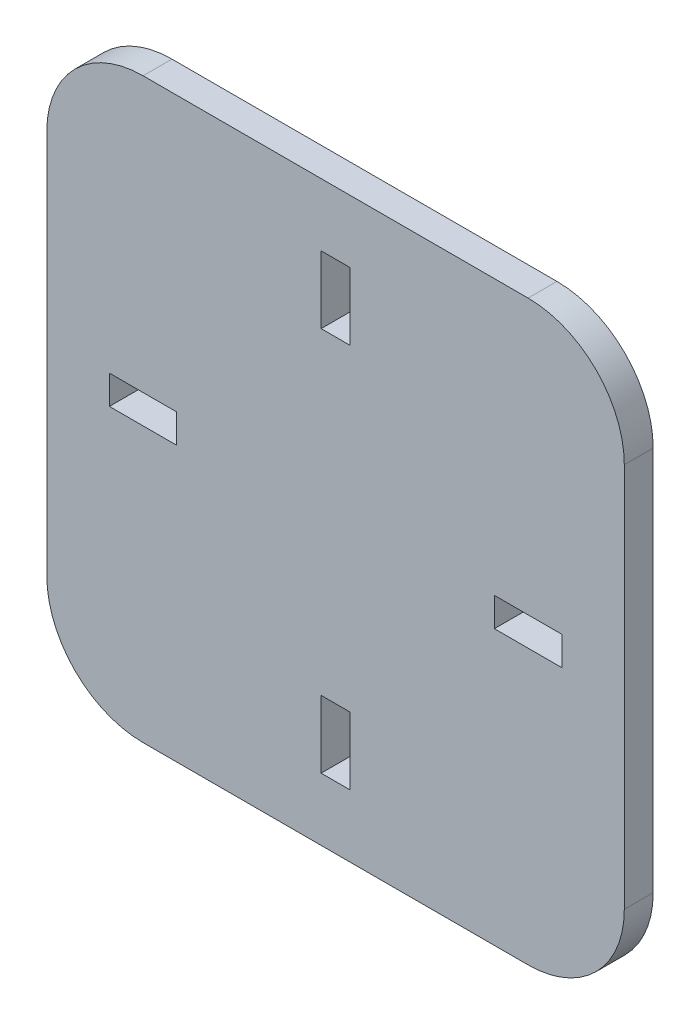
ISO-10303-21;
HEADER;
FILE_DESCRIPTION(('STEP AP214'),'2;1');
FILE_NAME('part.step','',(''),(''),'','','');
FILE_SCHEMA(('AUTOMOTIVE_DESIGN { 1 0 10303 214 1 1 1 1 }'));
ENDSEC;
DATA;
#1=APPLICATION_CONTEXT('core data for automotive mechanical design processes');
#2=APPLICATION_PROTOCOL_DEFINITION('international standard','automotive_design',2000,#1);
#3=PRODUCT_CONTEXT('',#1,'mechanical');
#4=PRODUCT('Part','Part','',(#3));
#5=PRODUCT_RELATED_PRODUCT_CATEGORY('part','',(#4));
#6=PRODUCT_DEFINITION_FORMATION('','',#4);
#7=PRODUCT_DEFINITION_CONTEXT('part definition',#1,'design');
#8=PRODUCT_DEFINITION('design','',#6,#7);
#9=PRODUCT_DEFINITION_SHAPE('','',#8);
#10=(LENGTH_UNIT() NAMED_UNIT(*) SI_UNIT(.MILLI.,.METRE.));
#11=(NAMED_UNIT(*) PLANE_ANGLE_UNIT() SI_UNIT($,.RADIAN.));
#12=(NAMED_UNIT(*) SI_UNIT($,.STERADIAN.) SOLID_ANGLE_UNIT());
#13=UNCERTAINTY_MEASURE_WITH_UNIT(LENGTH_MEASURE(1.E-05),#10,'distance_accuracy_value','');
#14=(GEOMETRIC_REPRESENTATION_CONTEXT(3) GLOBAL_UNCERTAINTY_ASSIGNED_CONTEXT((#13)) GLOBAL_UNIT_ASSIGNED_CONTEXT((#10,
#11,#12)) REPRESENTATION_CONTEXT('',''));
#15=CARTESIAN_POINT('',(0.,0.,0.));
#16=DIRECTION('',(0.,0.,1.));
#17=DIRECTION('',(1.,0.,0.));
#18=AXIS2_PLACEMENT_3D('',#15,#16,#17);
#19=CARTESIAN_POINT('',(30.,-30.,3.));
#20=DIRECTION('',(-1.,0.,0.));
#21=DIRECTION('',(0.,0.,1.));
#22=AXIS2_PLACEMENT_3D('',#19,#20,#21);
#23=PLANE('',#22);
#24=DIRECTION('',(0.,1.,0.));
#25=VECTOR('',#24,1.);
#26=CARTESIAN_POINT('',(30.,-30.,0.));
#27=LINE('',#26,#25);
#28=CARTESIAN_POINT('',(30.,-20.,0.));
#29=VERTEX_POINT('',#28);
#30=CARTESIAN_POINT('',(30.,20.,0.));
#31=VERTEX_POINT('',#30);
#32=EDGE_CURVE('E241',#29,#31,#27,.T.);
#33=ORIENTED_EDGE('',*,*,#32,.T.);
#34=DIRECTION('',(0.,0.,-1.));
#35=VECTOR('',#34,1.);
#36=CARTESIAN_POINT('',(30.,20.,3.));
#37=LINE('',#36,#35);
#38=CARTESIAN_POINT('',(30.,20.,3.));
#39=VERTEX_POINT('',#38);
#40=EDGE_CURVE('E388',#31,#39,#37,.F.);
#41=ORIENTED_EDGE('',*,*,#40,.T.);
#42=DIRECTION('',(0.,1.,0.));
#43=VECTOR('',#42,1.);
#44=CARTESIAN_POINT('',(30.,-30.,3.));
#45=LINE('',#44,#43);
#46=CARTESIAN_POINT('',(30.,-20.,3.));
#47=VERTEX_POINT('',#46);
#48=EDGE_CURVE('E340',#47,#39,#45,.T.);
#49=ORIENTED_EDGE('',*,*,#48,.F.);
#50=DIRECTION('',(0.,0.,-1.));
#51=VECTOR('',#50,1.);
#52=CARTESIAN_POINT('',(30.,-20.,3.));
#53=LINE('',#52,#51);
#54=EDGE_CURVE('E385',#47,#29,#53,.T.);
#55=ORIENTED_EDGE('',*,*,#54,.T.);
#56=EDGE_LOOP('',(#33,#41,#49,#55));
#57=FACE_BOUND('',#56,.T.);
#58=ADVANCED_FACE('F39',(#57),#23,.F.);
#59=CARTESIAN_POINT('',(-30.,30.,3.));
#60=DIRECTION('',(0.,-1.,0.));
#61=DIRECTION('',(0.,0.,-1.));
#62=AXIS2_PLACEMENT_3D('',#59,#60,#61);
#63=PLANE('',#62);
#64=DIRECTION('',(-1.,0.,0.));
#65=VECTOR('',#64,1.);
#66=CARTESIAN_POINT('',(-30.,30.,0.));
#67=LINE('',#66,#65);
#68=CARTESIAN_POINT('',(20.,30.,0.));
#69=VERTEX_POINT('',#68);
#70=CARTESIAN_POINT('',(-20.,30.,0.));
#71=VERTEX_POINT('',#70);
#72=EDGE_CURVE('E354',#69,#71,#67,.T.);
#73=ORIENTED_EDGE('',*,*,#72,.T.);
#74=DIRECTION('',(0.,0.,-1.));
#75=VECTOR('',#74,1.);
#76=CARTESIAN_POINT('',(-20.,30.,3.));
#77=LINE('',#76,#75);
#78=CARTESIAN_POINT('',(-20.,30.,3.));
#79=VERTEX_POINT('',#78);
#80=EDGE_CURVE('E376',#71,#79,#77,.F.);
#81=ORIENTED_EDGE('',*,*,#80,.T.);
#82=DIRECTION('',(-1.,0.,0.));
#83=VECTOR('',#82,1.);
#84=CARTESIAN_POINT('',(-30.,30.,3.));
#85=LINE('',#84,#83);
#86=CARTESIAN_POINT('',(20.,30.,3.));
#87=VERTEX_POINT('',#86);
#88=EDGE_CURVE('E343',#87,#79,#85,.T.);
#89=ORIENTED_EDGE('',*,*,#88,.F.);
#90=DIRECTION('',(0.,0.,-1.));
#91=VECTOR('',#90,1.);
#92=CARTESIAN_POINT('',(20.,30.,3.));
#93=LINE('',#92,#91);
#94=EDGE_CURVE('E373',#87,#69,#93,.T.);
#95=ORIENTED_EDGE('',*,*,#94,.T.);
#96=EDGE_LOOP('',(#73,#81,#89,#95));
#97=FACE_BOUND('',#96,.T.);
#98=ADVANCED_FACE('F412',(#97),#63,.F.);
#99=CARTESIAN_POINT('',(-30.,-30.,3.));
#100=DIRECTION('',(1.,0.,0.));
#101=DIRECTION('',(0.,0.,-1.));
#102=AXIS2_PLACEMENT_3D('',#99,#100,#101);
#103=PLANE('',#102);
#104=DIRECTION('',(0.,-1.,0.));
#105=VECTOR('',#104,1.);
#106=CARTESIAN_POINT('',(-30.,-30.,3.));
#107=LINE('',#106,#105);
#108=CARTESIAN_POINT('',(-30.,20.,3.));
#109=VERTEX_POINT('',#108);
#110=CARTESIAN_POINT('',(-30.,-20.,3.));
#111=VERTEX_POINT('',#110);
#112=EDGE_CURVE('E347',#109,#111,#107,.T.);
#113=ORIENTED_EDGE('',*,*,#112,.F.);
#114=DIRECTION('',(0.,0.,-1.));
#115=VECTOR('',#114,1.);
#116=CARTESIAN_POINT('',(-30.,20.,3.));
#117=LINE('',#116,#115);
#118=CARTESIAN_POINT('',(-30.,20.,0.));
#119=VERTEX_POINT('',#118);
#120=EDGE_CURVE('E362',#109,#119,#117,.T.);
#121=ORIENTED_EDGE('',*,*,#120,.T.);
#122=DIRECTION('',(0.,-1.,0.));
#123=VECTOR('',#122,1.);
#124=CARTESIAN_POINT('',(-30.,-30.,0.));
#125=LINE('',#124,#123);
#126=CARTESIAN_POINT('',(-30.,-20.,0.));
#127=VERTEX_POINT('',#126);
#128=EDGE_CURVE('E357',#119,#127,#125,.T.);
#129=ORIENTED_EDGE('',*,*,#128,.T.);
#130=DIRECTION('',(0.,0.,-1.));
#131=VECTOR('',#130,1.);
#132=CARTESIAN_POINT('',(-30.,-20.,3.));
#133=LINE('',#132,#131);
#134=EDGE_CURVE('E351',#127,#111,#133,.F.);
#135=ORIENTED_EDGE('',*,*,#134,.T.);
#136=EDGE_LOOP('',(#113,#121,#129,#135));
#137=FACE_BOUND('',#136,.T.);
#138=ADVANCED_FACE('F420',(#137),#103,.F.);
#139=CARTESIAN_POINT('',(-30.,-30.,3.));
#140=DIRECTION('',(0.,1.,0.));
#141=DIRECTION('',(0.,0.,1.));
#142=AXIS2_PLACEMENT_3D('',#139,#140,#141);
#143=PLANE('',#142);
#144=DIRECTION('',(1.,0.,0.));
#145=VECTOR('',#144,1.);
#146=CARTESIAN_POINT('',(-30.,-30.,0.));
#147=LINE('',#146,#145);
#148=CARTESIAN_POINT('',(-20.,-30.,0.));
#149=VERTEX_POINT('',#148);
#150=CARTESIAN_POINT('',(20.,-30.,0.));
#151=VERTEX_POINT('',#150);
#152=EDGE_CURVE('E344',#149,#151,#147,.T.);
#153=ORIENTED_EDGE('',*,*,#152,.T.);
#154=DIRECTION('',(0.,0.,-1.));
#155=VECTOR('',#154,1.);
#156=CARTESIAN_POINT('',(20.,-30.,3.));
#157=LINE('',#156,#155);
#158=CARTESIAN_POINT('',(20.,-30.,3.));
#159=VERTEX_POINT('',#158);
#160=EDGE_CURVE('E11',#151,#159,#157,.F.);
#161=ORIENTED_EDGE('',*,*,#160,.T.);
#162=DIRECTION('',(1.,0.,0.));
#163=VECTOR('',#162,1.);
#164=CARTESIAN_POINT('',(-30.,-30.,3.));
#165=LINE('',#164,#163);
#166=CARTESIAN_POINT('',(-20.,-30.,3.));
#167=VERTEX_POINT('',#166);
#168=EDGE_CURVE('E349',#167,#159,#165,.T.);
#169=ORIENTED_EDGE('',*,*,#168,.F.);
#170=DIRECTION('',(0.,0.,-1.));
#171=VECTOR('',#170,1.);
#172=CARTESIAN_POINT('',(-20.,-30.,3.));
#173=LINE('',#172,#171);
#174=EDGE_CURVE('E47',#167,#149,#173,.T.);
#175=ORIENTED_EDGE('',*,*,#174,.T.);
#176=EDGE_LOOP('',(#153,#161,#169,#175));
#177=FACE_BOUND('',#176,.T.);
#178=ADVANCED_FACE('F392',(#177),#143,.F.);
#179=CARTESIAN_POINT('',(0.,0.,3.));
#180=DIRECTION('',(0.,0.,-1.));
#181=DIRECTION('',(-1.,0.,0.));
#182=AXIS2_PLACEMENT_3D('',#179,#180,#181);
#183=PLANE('',#182);
#184=DIRECTION('',(-1.,0.,0.));
#185=VECTOR('',#184,1.);
#186=CARTESIAN_POINT('',(16.5,1.5,3.));
#187=LINE('',#186,#185);
#188=CARTESIAN_POINT('',(23.5,1.5,3.));
#189=VERTEX_POINT('',#188);
#190=CARTESIAN_POINT('',(16.5,1.5,3.));
#191=VERTEX_POINT('',#190);
#192=EDGE_CURVE('E234',#189,#191,#187,.T.);
#193=ORIENTED_EDGE('',*,*,#192,.F.);
#194=DIRECTION('',(0.,1.,0.));
#195=VECTOR('',#194,1.);
#196=CARTESIAN_POINT('',(23.5,1.5,3.));
#197=LINE('',#196,#195);
#198=CARTESIAN_POINT('',(23.5,-1.5,3.));
#199=VERTEX_POINT('',#198);
#200=EDGE_CURVE('E207',#199,#189,#197,.T.);
#201=ORIENTED_EDGE('',*,*,#200,.F.);
#202=DIRECTION('',(1.,0.,0.));
#203=VECTOR('',#202,1.);
#204=CARTESIAN_POINT('',(16.5,-1.5,3.));
#205=LINE('',#204,#203);
#206=CARTESIAN_POINT('',(16.5,-1.5,3.));
#207=VERTEX_POINT('',#206);
#208=EDGE_CURVE('E225',#207,#199,#205,.T.);
#209=ORIENTED_EDGE('',*,*,#208,.F.);
#210=DIRECTION('',(0.,-1.,0.));
#211=VECTOR('',#210,1.);
#212=CARTESIAN_POINT('',(16.5,1.5,3.));
#213=LINE('',#212,#211);
#214=EDGE_CURVE('E228',#191,#207,#213,.T.);
#215=ORIENTED_EDGE('',*,*,#214,.F.);
#216=EDGE_LOOP('',(#193,#201,#209,#215));
#217=FACE_BOUND('',#216,.T.);
#218=DIRECTION('',(0.,1.,0.));
#219=VECTOR('',#218,1.);
#220=CARTESIAN_POINT('',(1.5,-16.5,3.));
#221=LINE('',#220,#219);
#222=CARTESIAN_POINT('',(1.50000000000001,-23.5,3.));
#223=VERTEX_POINT('',#222);
#224=CARTESIAN_POINT('',(1.5,-16.5,3.));
#225=VERTEX_POINT('',#224);
#226=EDGE_CURVE('E263',#223,#225,#221,.T.);
#227=ORIENTED_EDGE('',*,*,#226,.F.);
#228=DIRECTION('',(1.,0.,0.));
#229=VECTOR('',#228,1.);
#230=CARTESIAN_POINT('',(1.50000000000001,-23.5,3.));
#231=LINE('',#230,#229);
#232=CARTESIAN_POINT('',(-1.5,-23.5,3.));
#233=VERTEX_POINT('',#232);
#234=EDGE_CURVE('E235',#233,#223,#231,.T.);
#235=ORIENTED_EDGE('',*,*,#234,.F.);
#236=DIRECTION('',(0.,-1.,0.));
#237=VECTOR('',#236,1.);
#238=CARTESIAN_POINT('',(-1.5,-16.5,3.));
#239=LINE('',#238,#237);
#240=CARTESIAN_POINT('',(-1.5,-16.5,3.));
#241=VERTEX_POINT('',#240);
#242=EDGE_CURVE('E256',#241,#233,#239,.T.);
#243=ORIENTED_EDGE('',*,*,#242,.F.);
#244=DIRECTION('',(-1.,0.,0.));
#245=VECTOR('',#244,1.);
#246=CARTESIAN_POINT('',(1.5,-16.5,3.));
#247=LINE('',#246,#245);
#248=EDGE_CURVE('E259',#225,#241,#247,.T.);
#249=ORIENTED_EDGE('',*,*,#248,.F.);
#250=EDGE_LOOP('',(#227,#235,#243,#249));
#251=FACE_BOUND('',#250,.T.);
#252=DIRECTION('',(1.,0.,0.));
#253=VECTOR('',#252,1.);
#254=CARTESIAN_POINT('',(-16.5,-1.50000000000001,3.));
#255=LINE('',#254,#253);
#256=CARTESIAN_POINT('',(-23.5,-1.50000000000001,3.));
#257=VERTEX_POINT('',#256);
#258=CARTESIAN_POINT('',(-16.5,-1.50000000000001,3.));
#259=VERTEX_POINT('',#258);
#260=EDGE_CURVE('E295',#257,#259,#255,.T.);
#261=ORIENTED_EDGE('',*,*,#260,.F.);
#262=DIRECTION('',(0.,-1.,0.));
#263=VECTOR('',#262,1.);
#264=CARTESIAN_POINT('',(-23.5,-1.50000000000001,3.));
#265=LINE('',#264,#263);
#266=CARTESIAN_POINT('',(-23.5,1.49999999999999,3.));
#267=VERTEX_POINT('',#266);
#268=EDGE_CURVE('E255',#267,#257,#265,.T.);
#269=ORIENTED_EDGE('',*,*,#268,.F.);
#270=DIRECTION('',(-1.,0.,0.));
#271=VECTOR('',#270,1.);
#272=CARTESIAN_POINT('',(-16.5,1.5,3.));
#273=LINE('',#272,#271);
#274=CARTESIAN_POINT('',(-16.5,1.5,3.));
#275=VERTEX_POINT('',#274);
#276=EDGE_CURVE('E288',#275,#267,#273,.T.);
#277=ORIENTED_EDGE('',*,*,#276,.F.);
#278=DIRECTION('',(0.,1.,0.));
#279=VECTOR('',#278,1.);
#280=CARTESIAN_POINT('',(-16.5,-1.50000000000001,3.));
#281=LINE('',#280,#279);
#282=EDGE_CURVE('E291',#259,#275,#281,.T.);
#283=ORIENTED_EDGE('',*,*,#282,.F.);
#284=EDGE_LOOP('',(#261,#269,#277,#283));
#285=FACE_BOUND('',#284,.T.);
#286=DIRECTION('',(-1.,0.,0.));
#287=VECTOR('',#286,1.);
#288=CARTESIAN_POINT('',(-1.5,23.5,3.));
#289=LINE('',#288,#287);
#290=CARTESIAN_POINT('',(1.5,23.5,3.));
#291=VERTEX_POINT('',#290);
#292=CARTESIAN_POINT('',(-1.5,23.5,3.));
#293=VERTEX_POINT('',#292);
#294=EDGE_CURVE('E326',#291,#293,#289,.T.);
#295=ORIENTED_EDGE('',*,*,#294,.F.);
#296=DIRECTION('',(0.,1.,0.));
#297=VECTOR('',#296,1.);
#298=CARTESIAN_POINT('',(1.5,16.5,3.));
#299=LINE('',#298,#297);
#300=CARTESIAN_POINT('',(1.5,16.5,3.));
#301=VERTEX_POINT('',#300);
#302=EDGE_CURVE('E287',#301,#291,#299,.T.);
#303=ORIENTED_EDGE('',*,*,#302,.F.);
#304=DIRECTION('',(1.,0.,0.));
#305=VECTOR('',#304,1.);
#306=CARTESIAN_POINT('',(-1.5,16.5,3.));
#307=LINE('',#306,#305);
#308=CARTESIAN_POINT('',(-1.5,16.5,3.));
#309=VERTEX_POINT('',#308);
#310=EDGE_CURVE('E319',#309,#301,#307,.T.);
#311=ORIENTED_EDGE('',*,*,#310,.F.);
#312=DIRECTION('',(0.,-1.,0.));
#313=VECTOR('',#312,1.);
#314=CARTESIAN_POINT('',(-1.5,16.5,3.));
#315=LINE('',#314,#313);
#316=EDGE_CURVE('E322',#293,#309,#315,.T.);
#317=ORIENTED_EDGE('',*,*,#316,.F.);
#318=EDGE_LOOP('',(#295,#303,#311,#317));
#319=FACE_BOUND('',#318,.T.);
#320=ORIENTED_EDGE('',*,*,#88,.T.);
#321=CARTESIAN_POINT('',(-20.,20.,3.));
#322=DIRECTION('',(0.,0.,-1.));
#323=DIRECTION('',(-1.,0.,0.));
#324=AXIS2_PLACEMENT_3D('',#321,#322,#323);
#325=CIRCLE('',#324,10.);
#326=EDGE_CURVE('E383',#79,#109,#325,.F.);
#327=ORIENTED_EDGE('',*,*,#326,.T.);
#328=ORIENTED_EDGE('',*,*,#112,.T.);
#329=CARTESIAN_POINT('',(-20.,-20.,3.));
#330=DIRECTION('',(0.,0.,-1.));
#331=DIRECTION('',(-1.,0.,0.));
#332=AXIS2_PLACEMENT_3D('',#329,#330,#331);
#333=CIRCLE('',#332,10.);
#334=EDGE_CURVE('E59',#111,#167,#333,.F.);
#335=ORIENTED_EDGE('',*,*,#334,.T.);
#336=ORIENTED_EDGE('',*,*,#168,.T.);
#337=CARTESIAN_POINT('',(20.,-20.,3.));
#338=DIRECTION('',(0.,0.,-1.));
#339=DIRECTION('',(-1.,0.,0.));
#340=AXIS2_PLACEMENT_3D('',#337,#338,#339);
#341=CIRCLE('',#340,10.);
#342=EDGE_CURVE('E379',#159,#47,#341,.F.);
#343=ORIENTED_EDGE('',*,*,#342,.T.);
#344=ORIENTED_EDGE('',*,*,#48,.T.);
#345=CARTESIAN_POINT('',(20.,20.,3.));
#346=DIRECTION('',(0.,0.,-1.));
#347=DIRECTION('',(-1.,0.,0.));
#348=AXIS2_PLACEMENT_3D('',#345,#346,#347);
#349=CIRCLE('',#348,10.);
#350=EDGE_CURVE('E381',#39,#87,#349,.F.);
#351=ORIENTED_EDGE('',*,*,#350,.T.);
#352=EDGE_LOOP('',(#320,#327,#328,#335,#336,#343,#344,#351));
#353=FACE_BOUND('',#352,.T.);
#354=ADVANCED_FACE('F405',(#217,#251,#285,#319,#353),#183,.F.);
#355=CARTESIAN_POINT('',(0.,0.,0.));
#356=DIRECTION('',(0.,0.,-1.));
#357=DIRECTION('',(-1.,0.,0.));
#358=AXIS2_PLACEMENT_3D('',#355,#356,#357);
#359=PLANE('',#358);
#360=DIRECTION('',(0.,1.,0.));
#361=VECTOR('',#360,1.);
#362=CARTESIAN_POINT('',(23.5,1.5,0.));
#363=LINE('',#362,#361);
#364=CARTESIAN_POINT('',(23.5,-1.5,0.));
#365=VERTEX_POINT('',#364);
#366=CARTESIAN_POINT('',(23.5,1.5,0.));
#367=VERTEX_POINT('',#366);
#368=EDGE_CURVE('E204',#365,#367,#363,.T.);
#369=ORIENTED_EDGE('',*,*,#368,.T.);
#370=DIRECTION('',(-1.,0.,0.));
#371=VECTOR('',#370,1.);
#372=CARTESIAN_POINT('',(16.5,1.5,0.));
#373=LINE('',#372,#371);
#374=CARTESIAN_POINT('',(16.5,1.5,0.));
#375=VERTEX_POINT('',#374);
#376=EDGE_CURVE('E216',#367,#375,#373,.T.);
#377=ORIENTED_EDGE('',*,*,#376,.T.);
#378=DIRECTION('',(0.,-1.,0.));
#379=VECTOR('',#378,1.);
#380=CARTESIAN_POINT('',(16.5,1.5,0.));
#381=LINE('',#380,#379);
#382=CARTESIAN_POINT('',(16.5,-1.5,0.));
#383=VERTEX_POINT('',#382);
#384=EDGE_CURVE('E220',#375,#383,#381,.T.);
#385=ORIENTED_EDGE('',*,*,#384,.T.);
#386=DIRECTION('',(1.,0.,0.));
#387=VECTOR('',#386,1.);
#388=CARTESIAN_POINT('',(16.5,-1.5,0.));
#389=LINE('',#388,#387);
#390=EDGE_CURVE('E212',#383,#365,#389,.T.);
#391=ORIENTED_EDGE('',*,*,#390,.T.);
#392=EDGE_LOOP('',(#369,#377,#385,#391));
#393=FACE_BOUND('',#392,.T.);
#394=DIRECTION('',(1.,0.,0.));
#395=VECTOR('',#394,1.);
#396=CARTESIAN_POINT('',(1.50000000000001,-23.5,0.));
#397=LINE('',#396,#395);
#398=CARTESIAN_POINT('',(-1.5,-23.5,0.));
#399=VERTEX_POINT('',#398);
#400=CARTESIAN_POINT('',(1.50000000000001,-23.5,0.));
#401=VERTEX_POINT('',#400);
#402=EDGE_CURVE('E260',#399,#401,#397,.T.);
#403=ORIENTED_EDGE('',*,*,#402,.T.);
#404=DIRECTION('',(0.,1.,0.));
#405=VECTOR('',#404,1.);
#406=CARTESIAN_POINT('',(1.5,-16.5,0.));
#407=LINE('',#406,#405);
#408=CARTESIAN_POINT('',(1.5,-16.5,0.));
#409=VERTEX_POINT('',#408);
#410=EDGE_CURVE('E272',#401,#409,#407,.T.);
#411=ORIENTED_EDGE('',*,*,#410,.T.);
#412=DIRECTION('',(-1.,0.,0.));
#413=VECTOR('',#412,1.);
#414=CARTESIAN_POINT('',(1.5,-16.5,0.));
#415=LINE('',#414,#413);
#416=CARTESIAN_POINT('',(-1.5,-16.5,0.));
#417=VERTEX_POINT('',#416);
#418=EDGE_CURVE('E269',#409,#417,#415,.T.);
#419=ORIENTED_EDGE('',*,*,#418,.T.);
#420=DIRECTION('',(0.,-1.,0.));
#421=VECTOR('',#420,1.);
#422=CARTESIAN_POINT('',(-1.5,-16.5,0.));
#423=LINE('',#422,#421);
#424=EDGE_CURVE('E248',#417,#399,#423,.T.);
#425=ORIENTED_EDGE('',*,*,#424,.T.);
#426=EDGE_LOOP('',(#403,#411,#419,#425));
#427=FACE_BOUND('',#426,.T.);
#428=DIRECTION('',(0.,-1.,0.));
#429=VECTOR('',#428,1.);
#430=CARTESIAN_POINT('',(-23.5,-1.50000000000001,0.));
#431=LINE('',#430,#429);
#432=CARTESIAN_POINT('',(-23.5,1.49999999999999,0.));
#433=VERTEX_POINT('',#432);
#434=CARTESIAN_POINT('',(-23.5,-1.50000000000001,0.));
#435=VERTEX_POINT('',#434);
#436=EDGE_CURVE('E292',#433,#435,#431,.T.);
#437=ORIENTED_EDGE('',*,*,#436,.T.);
#438=DIRECTION('',(1.,0.,0.));
#439=VECTOR('',#438,1.);
#440=CARTESIAN_POINT('',(-16.5,-1.50000000000001,0.));
#441=LINE('',#440,#439);
#442=CARTESIAN_POINT('',(-16.5,-1.50000000000001,0.));
#443=VERTEX_POINT('',#442);
#444=EDGE_CURVE('E304',#435,#443,#441,.T.);
#445=ORIENTED_EDGE('',*,*,#444,.T.);
#446=DIRECTION('',(0.,1.,0.));
#447=VECTOR('',#446,1.);
#448=CARTESIAN_POINT('',(-16.5,-1.50000000000001,0.));
#449=LINE('',#448,#447);
#450=CARTESIAN_POINT('',(-16.5,1.5,0.));
#451=VERTEX_POINT('',#450);
#452=EDGE_CURVE('E301',#443,#451,#449,.T.);
#453=ORIENTED_EDGE('',*,*,#452,.T.);
#454=DIRECTION('',(-1.,0.,0.));
#455=VECTOR('',#454,1.);
#456=CARTESIAN_POINT('',(-16.5,1.5,0.));
#457=LINE('',#456,#455);
#458=EDGE_CURVE('E280',#451,#433,#457,.T.);
#459=ORIENTED_EDGE('',*,*,#458,.T.);
#460=EDGE_LOOP('',(#437,#445,#453,#459));
#461=FACE_BOUND('',#460,.T.);
#462=DIRECTION('',(0.,1.,0.));
#463=VECTOR('',#462,1.);
#464=CARTESIAN_POINT('',(1.5,16.5,0.));
#465=LINE('',#464,#463);
#466=CARTESIAN_POINT('',(1.5,16.5,0.));
#467=VERTEX_POINT('',#466);
#468=CARTESIAN_POINT('',(1.5,23.5,0.));
#469=VERTEX_POINT('',#468);
#470=EDGE_CURVE('E323',#467,#469,#465,.T.);
#471=ORIENTED_EDGE('',*,*,#470,.T.);
#472=DIRECTION('',(-1.,0.,0.));
#473=VECTOR('',#472,1.);
#474=CARTESIAN_POINT('',(-1.5,23.5,0.));
#475=LINE('',#474,#473);
#476=CARTESIAN_POINT('',(-1.5,23.5,0.));
#477=VERTEX_POINT('',#476);
#478=EDGE_CURVE('E335',#469,#477,#475,.T.);
#479=ORIENTED_EDGE('',*,*,#478,.T.);
#480=DIRECTION('',(0.,-1.,0.));
#481=VECTOR('',#480,1.);
#482=CARTESIAN_POINT('',(-1.5,16.5,0.));
#483=LINE('',#482,#481);
#484=CARTESIAN_POINT('',(-1.5,16.5,0.));
#485=VERTEX_POINT('',#484);
#486=EDGE_CURVE('E332',#477,#485,#483,.T.);
#487=ORIENTED_EDGE('',*,*,#486,.T.);
#488=DIRECTION('',(1.,0.,0.));
#489=VECTOR('',#488,1.);
#490=CARTESIAN_POINT('',(-1.5,16.5,0.));
#491=LINE('',#490,#489);
#492=EDGE_CURVE('E312',#485,#467,#491,.T.);
#493=ORIENTED_EDGE('',*,*,#492,.T.);
#494=EDGE_LOOP('',(#471,#479,#487,#493));
#495=FACE_BOUND('',#494,.T.);
#496=ORIENTED_EDGE('',*,*,#128,.F.);
#497=CARTESIAN_POINT('',(-20.,20.,0.));
#498=DIRECTION('',(0.,0.,-1.));
#499=DIRECTION('',(-1.,0.,0.));
#500=AXIS2_PLACEMENT_3D('',#497,#498,#499);
#501=CIRCLE('',#500,10.);
#502=EDGE_CURVE('E371',#119,#71,#501,.T.);
#503=ORIENTED_EDGE('',*,*,#502,.T.);
#504=ORIENTED_EDGE('',*,*,#72,.F.);
#505=CARTESIAN_POINT('',(20.,20.,0.));
#506=DIRECTION('',(0.,0.,-1.));
#507=DIRECTION('',(-1.,0.,0.));
#508=AXIS2_PLACEMENT_3D('',#505,#506,#507);
#509=CIRCLE('',#508,10.);
#510=EDGE_CURVE('E369',#69,#31,#509,.T.);
#511=ORIENTED_EDGE('',*,*,#510,.T.);
#512=ORIENTED_EDGE('',*,*,#32,.F.);
#513=CARTESIAN_POINT('',(20.,-20.,0.));
#514=DIRECTION('',(0.,0.,-1.));
#515=DIRECTION('',(-1.,0.,0.));
#516=AXIS2_PLACEMENT_3D('',#513,#514,#515);
#517=CIRCLE('',#516,10.);
#518=EDGE_CURVE('E367',#29,#151,#517,.T.);
#519=ORIENTED_EDGE('',*,*,#518,.T.);
#520=ORIENTED_EDGE('',*,*,#152,.F.);
#521=CARTESIAN_POINT('',(-20.,-20.,0.));
#522=DIRECTION('',(0.,0.,-1.));
#523=DIRECTION('',(-1.,0.,0.));
#524=AXIS2_PLACEMENT_3D('',#521,#522,#523);
#525=CIRCLE('',#524,10.);
#526=EDGE_CURVE('E365',#149,#127,#525,.T.);
#527=ORIENTED_EDGE('',*,*,#526,.T.);
#528=EDGE_LOOP('',(#496,#503,#504,#511,#512,#519,#520,#527));
#529=FACE_BOUND('',#528,.T.);
#530=ADVANCED_FACE('F222',(#393,#427,#461,#495,#529),#359,.T.);
#531=CARTESIAN_POINT('',(1.5,16.5,0.));
#532=DIRECTION('',(1.,0.,0.));
#533=DIRECTION('',(0.,0.,-1.));
#534=AXIS2_PLACEMENT_3D('',#531,#532,#533);
#535=PLANE('',#534);
#536=ORIENTED_EDGE('',*,*,#302,.T.);
#537=DIRECTION('',(0.,0.,1.));
#538=VECTOR('',#537,1.);
#539=CARTESIAN_POINT('',(1.5,23.5,0.));
#540=LINE('',#539,#538);
#541=EDGE_CURVE('E309',#469,#291,#540,.T.);
#542=ORIENTED_EDGE('',*,*,#541,.F.);
#543=ORIENTED_EDGE('',*,*,#470,.F.);
#544=DIRECTION('',(0.,0.,1.));
#545=VECTOR('',#544,1.);
#546=CARTESIAN_POINT('',(1.5,16.5,0.));
#547=LINE('',#546,#545);
#548=EDGE_CURVE('E317',#467,#301,#547,.T.);
#549=ORIENTED_EDGE('',*,*,#548,.T.);
#550=EDGE_LOOP('',(#536,#542,#543,#549));
#551=FACE_BOUND('',#550,.T.);
#552=ADVANCED_FACE('F588',(#551),#535,.F.);
#553=CARTESIAN_POINT('',(-1.5,16.5,0.));
#554=DIRECTION('',(0.,-1.,0.));
#555=DIRECTION('',(0.,0.,-1.));
#556=AXIS2_PLACEMENT_3D('',#553,#554,#555);
#557=PLANE('',#556);
#558=ORIENTED_EDGE('',*,*,#310,.T.);
#559=ORIENTED_EDGE('',*,*,#548,.F.);
#560=ORIENTED_EDGE('',*,*,#492,.F.);
#561=DIRECTION('',(0.,0.,1.));
#562=VECTOR('',#561,1.);
#563=CARTESIAN_POINT('',(-1.5,16.5,0.));
#564=LINE('',#563,#562);
#565=EDGE_CURVE('E315',#485,#309,#564,.T.);
#566=ORIENTED_EDGE('',*,*,#565,.T.);
#567=EDGE_LOOP('',(#558,#559,#560,#566));
#568=FACE_BOUND('',#567,.T.);
#569=ADVANCED_FACE('F579',(#568),#557,.F.);
#570=CARTESIAN_POINT('',(-1.5,16.5,0.));
#571=DIRECTION('',(-1.,0.,0.));
#572=DIRECTION('',(0.,0.,1.));
#573=AXIS2_PLACEMENT_3D('',#570,#571,#572);
#574=PLANE('',#573);
#575=ORIENTED_EDGE('',*,*,#316,.T.);
#576=ORIENTED_EDGE('',*,*,#565,.F.);
#577=ORIENTED_EDGE('',*,*,#486,.F.);
#578=DIRECTION('',(0.,0.,1.));
#579=VECTOR('',#578,1.);
#580=CARTESIAN_POINT('',(-1.5,23.5,0.));
#581=LINE('',#580,#579);
#582=EDGE_CURVE('E313',#477,#293,#581,.T.);
#583=ORIENTED_EDGE('',*,*,#582,.T.);
#584=EDGE_LOOP('',(#575,#576,#577,#583));
#585=FACE_BOUND('',#584,.T.);
#586=ADVANCED_FACE('F570',(#585),#574,.F.);
#587=CARTESIAN_POINT('',(-1.5,23.5,0.));
#588=DIRECTION('',(0.,1.,0.));
#589=DIRECTION('',(0.,0.,1.));
#590=AXIS2_PLACEMENT_3D('',#587,#588,#589);
#591=PLANE('',#590);
#592=ORIENTED_EDGE('',*,*,#294,.T.);
#593=ORIENTED_EDGE('',*,*,#582,.F.);
#594=ORIENTED_EDGE('',*,*,#478,.F.);
#595=ORIENTED_EDGE('',*,*,#541,.T.);
#596=EDGE_LOOP('',(#592,#593,#594,#595));
#597=FACE_BOUND('',#596,.T.);
#598=ADVANCED_FACE('F561',(#597),#591,.F.);
#599=CARTESIAN_POINT('',(-23.5,-1.50000000000001,0.));
#600=DIRECTION('',(-1.,0.,0.));
#601=DIRECTION('',(0.,0.,1.));
#602=AXIS2_PLACEMENT_3D('',#599,#600,#601);
#603=PLANE('',#602);
#604=ORIENTED_EDGE('',*,*,#268,.T.);
#605=DIRECTION('',(0.,0.,1.));
#606=VECTOR('',#605,1.);
#607=CARTESIAN_POINT('',(-23.5,-1.50000000000001,0.));
#608=LINE('',#607,#606);
#609=EDGE_CURVE('E277',#435,#257,#608,.T.);
#610=ORIENTED_EDGE('',*,*,#609,.F.);
#611=ORIENTED_EDGE('',*,*,#436,.F.);
#612=DIRECTION('',(0.,0.,1.));
#613=VECTOR('',#612,1.);
#614=CARTESIAN_POINT('',(-23.5,1.49999999999999,0.));
#615=LINE('',#614,#613);
#616=EDGE_CURVE('E285',#433,#267,#615,.T.);
#617=ORIENTED_EDGE('',*,*,#616,.T.);
#618=EDGE_LOOP('',(#604,#610,#611,#617));
#619=FACE_BOUND('',#618,.T.);
#620=ADVANCED_FACE('F552',(#619),#603,.F.);
#621=CARTESIAN_POINT('',(-16.5,1.5,0.));
#622=DIRECTION('',(0.,1.,0.));
#623=DIRECTION('',(-1.,0.,0.));
#624=AXIS2_PLACEMENT_3D('',#621,#622,#623);
#625=PLANE('',#624);
#626=ORIENTED_EDGE('',*,*,#276,.T.);
#627=ORIENTED_EDGE('',*,*,#616,.F.);
#628=ORIENTED_EDGE('',*,*,#458,.F.);
#629=DIRECTION('',(0.,0.,1.));
#630=VECTOR('',#629,1.);
#631=CARTESIAN_POINT('',(-16.5,1.5,0.));
#632=LINE('',#631,#630);
#633=EDGE_CURVE('E283',#451,#275,#632,.T.);
#634=ORIENTED_EDGE('',*,*,#633,.T.);
#635=EDGE_LOOP('',(#626,#627,#628,#634));
#636=FACE_BOUND('',#635,.T.);
#637=ADVANCED_FACE('F543',(#636),#625,.F.);
#638=CARTESIAN_POINT('',(-16.5,-1.50000000000001,0.));
#639=DIRECTION('',(1.,0.,0.));
#640=DIRECTION('',(0.,0.,-1.));
#641=AXIS2_PLACEMENT_3D('',#638,#639,#640);
#642=PLANE('',#641);
#643=ORIENTED_EDGE('',*,*,#282,.T.);
#644=ORIENTED_EDGE('',*,*,#633,.F.);
#645=ORIENTED_EDGE('',*,*,#452,.F.);
#646=DIRECTION('',(0.,0.,1.));
#647=VECTOR('',#646,1.);
#648=CARTESIAN_POINT('',(-16.5,-1.50000000000001,0.));
#649=LINE('',#648,#647);
#650=EDGE_CURVE('E281',#443,#259,#649,.T.);
#651=ORIENTED_EDGE('',*,*,#650,.T.);
#652=EDGE_LOOP('',(#643,#644,#645,#651));
#653=FACE_BOUND('',#652,.T.);
#654=ADVANCED_FACE('F534',(#653),#642,.F.);
#655=CARTESIAN_POINT('',(-16.5,-1.50000000000001,0.));
#656=DIRECTION('',(0.,-1.,0.));
#657=DIRECTION('',(1.,0.,0.));
#658=AXIS2_PLACEMENT_3D('',#655,#656,#657);
#659=PLANE('',#658);
#660=ORIENTED_EDGE('',*,*,#260,.T.);
#661=ORIENTED_EDGE('',*,*,#650,.F.);
#662=ORIENTED_EDGE('',*,*,#444,.F.);
#663=ORIENTED_EDGE('',*,*,#609,.T.);
#664=EDGE_LOOP('',(#660,#661,#662,#663));
#665=FACE_BOUND('',#664,.T.);
#666=ADVANCED_FACE('F525',(#665),#659,.F.);
#667=CARTESIAN_POINT('',(1.50000000000001,-23.5,0.));
#668=DIRECTION('',(0.,-1.,0.));
#669=DIRECTION('',(0.,0.,-1.));
#670=AXIS2_PLACEMENT_3D('',#667,#668,#669);
#671=PLANE('',#670);
#672=ORIENTED_EDGE('',*,*,#234,.T.);
#673=DIRECTION('',(0.,0.,1.));
#674=VECTOR('',#673,1.);
#675=CARTESIAN_POINT('',(1.50000000000001,-23.5,0.));
#676=LINE('',#675,#674);
#677=EDGE_CURVE('E245',#401,#223,#676,.T.);
#678=ORIENTED_EDGE('',*,*,#677,.F.);
#679=ORIENTED_EDGE('',*,*,#402,.F.);
#680=DIRECTION('',(0.,0.,1.));
#681=VECTOR('',#680,1.);
#682=CARTESIAN_POINT('',(-1.5,-23.5,0.));
#683=LINE('',#682,#681);
#684=EDGE_CURVE('E253',#399,#233,#683,.T.);
#685=ORIENTED_EDGE('',*,*,#684,.T.);
#686=EDGE_LOOP('',(#672,#678,#679,#685));
#687=FACE_BOUND('',#686,.T.);
#688=ADVANCED_FACE('F516',(#687),#671,.F.);
#689=CARTESIAN_POINT('',(-1.5,-16.5,0.));
#690=DIRECTION('',(-1.,0.,0.));
#691=DIRECTION('',(0.,-1.,0.));
#692=AXIS2_PLACEMENT_3D('',#689,#690,#691);
#693=PLANE('',#692);
#694=ORIENTED_EDGE('',*,*,#242,.T.);
#695=ORIENTED_EDGE('',*,*,#684,.F.);
#696=ORIENTED_EDGE('',*,*,#424,.F.);
#697=DIRECTION('',(0.,0.,1.));
#698=VECTOR('',#697,1.);
#699=CARTESIAN_POINT('',(-1.5,-16.5,0.));
#700=LINE('',#699,#698);
#701=EDGE_CURVE('E251',#417,#241,#700,.T.);
#702=ORIENTED_EDGE('',*,*,#701,.T.);
#703=EDGE_LOOP('',(#694,#695,#696,#702));
#704=FACE_BOUND('',#703,.T.);
#705=ADVANCED_FACE('F507',(#704),#693,.F.);
#706=CARTESIAN_POINT('',(1.5,-16.5,0.));
#707=DIRECTION('',(0.,1.,0.));
#708=DIRECTION('',(0.,0.,1.));
#709=AXIS2_PLACEMENT_3D('',#706,#707,#708);
#710=PLANE('',#709);
#711=ORIENTED_EDGE('',*,*,#248,.T.);
#712=ORIENTED_EDGE('',*,*,#701,.F.);
#713=ORIENTED_EDGE('',*,*,#418,.F.);
#714=DIRECTION('',(0.,0.,1.));
#715=VECTOR('',#714,1.);
#716=CARTESIAN_POINT('',(1.5,-16.5,0.));
#717=LINE('',#716,#715);
#718=EDGE_CURVE('E249',#409,#225,#717,.T.);
#719=ORIENTED_EDGE('',*,*,#718,.T.);
#720=EDGE_LOOP('',(#711,#712,#713,#719));
#721=FACE_BOUND('',#720,.T.);
#722=ADVANCED_FACE('F498',(#721),#710,.F.);
#723=CARTESIAN_POINT('',(1.5,-16.5,0.));
#724=DIRECTION('',(1.,0.,0.));
#725=DIRECTION('',(0.,1.,0.));
#726=AXIS2_PLACEMENT_3D('',#723,#724,#725);
#727=PLANE('',#726);
#728=ORIENTED_EDGE('',*,*,#226,.T.);
#729=ORIENTED_EDGE('',*,*,#718,.F.);
#730=ORIENTED_EDGE('',*,*,#410,.F.);
#731=ORIENTED_EDGE('',*,*,#677,.T.);
#732=EDGE_LOOP('',(#728,#729,#730,#731));
#733=FACE_BOUND('',#732,.T.);
#734=ADVANCED_FACE('F490',(#733),#727,.F.);
#735=CARTESIAN_POINT('',(23.5,1.5,0.));
#736=DIRECTION('',(1.,0.,0.));
#737=DIRECTION('',(0.,0.,-1.));
#738=AXIS2_PLACEMENT_3D('',#735,#736,#737);
#739=PLANE('',#738);
#740=ORIENTED_EDGE('',*,*,#200,.T.);
#741=DIRECTION('',(0.,0.,1.));
#742=VECTOR('',#741,1.);
#743=CARTESIAN_POINT('',(23.5,1.5,0.));
#744=LINE('',#743,#742);
#745=EDGE_CURVE('E200',#367,#189,#744,.T.);
#746=ORIENTED_EDGE('',*,*,#745,.F.);
#747=ORIENTED_EDGE('',*,*,#368,.F.);
#748=DIRECTION('',(0.,0.,1.));
#749=VECTOR('',#748,1.);
#750=CARTESIAN_POINT('',(23.5,-1.5,0.));
#751=LINE('',#750,#749);
#752=EDGE_CURVE('E239',#365,#199,#751,.T.);
#753=ORIENTED_EDGE('',*,*,#752,.T.);
#754=EDGE_LOOP('',(#740,#746,#747,#753));
#755=FACE_BOUND('',#754,.T.);
#756=ADVANCED_FACE('F202',(#755),#739,.F.);
#757=CARTESIAN_POINT('',(16.5,-1.5,0.));
#758=DIRECTION('',(0.,-1.,0.));
#759=DIRECTION('',(0.,0.,-1.));
#760=AXIS2_PLACEMENT_3D('',#757,#758,#759);
#761=PLANE('',#760);
#762=ORIENTED_EDGE('',*,*,#208,.T.);
#763=ORIENTED_EDGE('',*,*,#752,.F.);
#764=ORIENTED_EDGE('',*,*,#390,.F.);
#765=DIRECTION('',(0.,0.,1.));
#766=VECTOR('',#765,1.);
#767=CARTESIAN_POINT('',(16.5,-1.5,0.));
#768=LINE('',#767,#766);
#769=EDGE_CURVE('E242',#383,#207,#768,.T.);
#770=ORIENTED_EDGE('',*,*,#769,.T.);
#771=EDGE_LOOP('',(#762,#763,#764,#770));
#772=FACE_BOUND('',#771,.T.);
#773=ADVANCED_FACE('F473',(#772),#761,.F.);
#774=CARTESIAN_POINT('',(16.5,1.5,0.));
#775=DIRECTION('',(-1.,0.,0.));
#776=DIRECTION('',(0.,0.,1.));
#777=AXIS2_PLACEMENT_3D('',#774,#775,#776);
#778=PLANE('',#777);
#779=ORIENTED_EDGE('',*,*,#214,.T.);
#780=ORIENTED_EDGE('',*,*,#769,.F.);
#781=ORIENTED_EDGE('',*,*,#384,.F.);
#782=DIRECTION('',(0.,0.,1.));
#783=VECTOR('',#782,1.);
#784=CARTESIAN_POINT('',(16.5,1.5,0.));
#785=LINE('',#784,#783);
#786=EDGE_CURVE('E211',#375,#191,#785,.T.);
#787=ORIENTED_EDGE('',*,*,#786,.T.);
#788=EDGE_LOOP('',(#779,#780,#781,#787));
#789=FACE_BOUND('',#788,.T.);
#790=ADVANCED_FACE('F465',(#789),#778,.F.);
#791=CARTESIAN_POINT('',(16.5,1.5,0.));
#792=DIRECTION('',(0.,1.,0.));
#793=DIRECTION('',(-1.,0.,0.));
#794=AXIS2_PLACEMENT_3D('',#791,#792,#793);
#795=PLANE('',#794);
#796=ORIENTED_EDGE('',*,*,#192,.T.);
#797=ORIENTED_EDGE('',*,*,#786,.F.);
#798=ORIENTED_EDGE('',*,*,#376,.F.);
#799=ORIENTED_EDGE('',*,*,#745,.T.);
#800=EDGE_LOOP('',(#796,#797,#798,#799));
#801=FACE_BOUND('',#800,.T.);
#802=ADVANCED_FACE('F217',(#801),#795,.F.);
#803=CARTESIAN_POINT('',(-20.,20.,3.));
#804=DIRECTION('',(0.,0.,-1.));
#805=DIRECTION('',(-1.,0.,0.));
#806=AXIS2_PLACEMENT_3D('',#803,#804,#805);
#807=CYLINDRICAL_SURFACE('',#806,10.);
#808=ORIENTED_EDGE('',*,*,#326,.F.);
#809=ORIENTED_EDGE('',*,*,#80,.F.);
#810=ORIENTED_EDGE('',*,*,#502,.F.);
#811=ORIENTED_EDGE('',*,*,#120,.F.);
#812=EDGE_LOOP('',(#808,#809,#810,#811));
#813=FACE_BOUND('',#812,.T.);
#814=ADVANCED_FACE('F417',(#813),#807,.T.);
#815=CARTESIAN_POINT('',(20.,20.,3.));
#816=DIRECTION('',(0.,0.,-1.));
#817=DIRECTION('',(-1.,0.,0.));
#818=AXIS2_PLACEMENT_3D('',#815,#816,#817);
#819=CYLINDRICAL_SURFACE('',#818,10.);
#820=ORIENTED_EDGE('',*,*,#350,.F.);
#821=ORIENTED_EDGE('',*,*,#40,.F.);
#822=ORIENTED_EDGE('',*,*,#510,.F.);
#823=ORIENTED_EDGE('',*,*,#94,.F.);
#824=EDGE_LOOP('',(#820,#821,#822,#823));
#825=FACE_BOUND('',#824,.T.);
#826=ADVANCED_FACE('F409',(#825),#819,.T.);
#827=CARTESIAN_POINT('',(20.,-20.,3.));
#828=DIRECTION('',(0.,0.,-1.));
#829=DIRECTION('',(-1.,0.,0.));
#830=AXIS2_PLACEMENT_3D('',#827,#828,#829);
#831=CYLINDRICAL_SURFACE('',#830,10.);
#832=ORIENTED_EDGE('',*,*,#342,.F.);
#833=ORIENTED_EDGE('',*,*,#160,.F.);
#834=ORIENTED_EDGE('',*,*,#518,.F.);
#835=ORIENTED_EDGE('',*,*,#54,.F.);
#836=EDGE_LOOP('',(#832,#833,#834,#835));
#837=FACE_BOUND('',#836,.T.);
#838=ADVANCED_FACE('F400',(#837),#831,.T.);
#839=CARTESIAN_POINT('',(-20.,-20.,3.));
#840=DIRECTION('',(0.,0.,-1.));
#841=DIRECTION('',(-1.,0.,0.));
#842=AXIS2_PLACEMENT_3D('',#839,#840,#841);
#843=CYLINDRICAL_SURFACE('',#842,10.);
#844=ORIENTED_EDGE('',*,*,#334,.F.);
#845=ORIENTED_EDGE('',*,*,#134,.F.);
#846=ORIENTED_EDGE('',*,*,#526,.F.);
#847=ORIENTED_EDGE('',*,*,#174,.F.);
#848=EDGE_LOOP('',(#844,#845,#846,#847));
#849=FACE_BOUND('',#848,.T.);
#850=ADVANCED_FACE('F41',(#849),#843,.T.);
#851=CLOSED_SHELL('',(#58,#98,#138,#178,#354,#530,#552,#569,#586,#598,#620,#637,#654,#666,#688,
#705,#722,#734,#756,#773,#790,#802,#814,#826,#838,#850));
#852=MANIFOLD_SOLID_BREP('B2',#851);
#853=ADVANCED_BREP_SHAPE_REPRESENTATION('',(#18,#852),#14);
#854=SHAPE_DEFINITION_REPRESENTATION(#9,#853);
ENDSEC;
END-ISO-10303-21;
